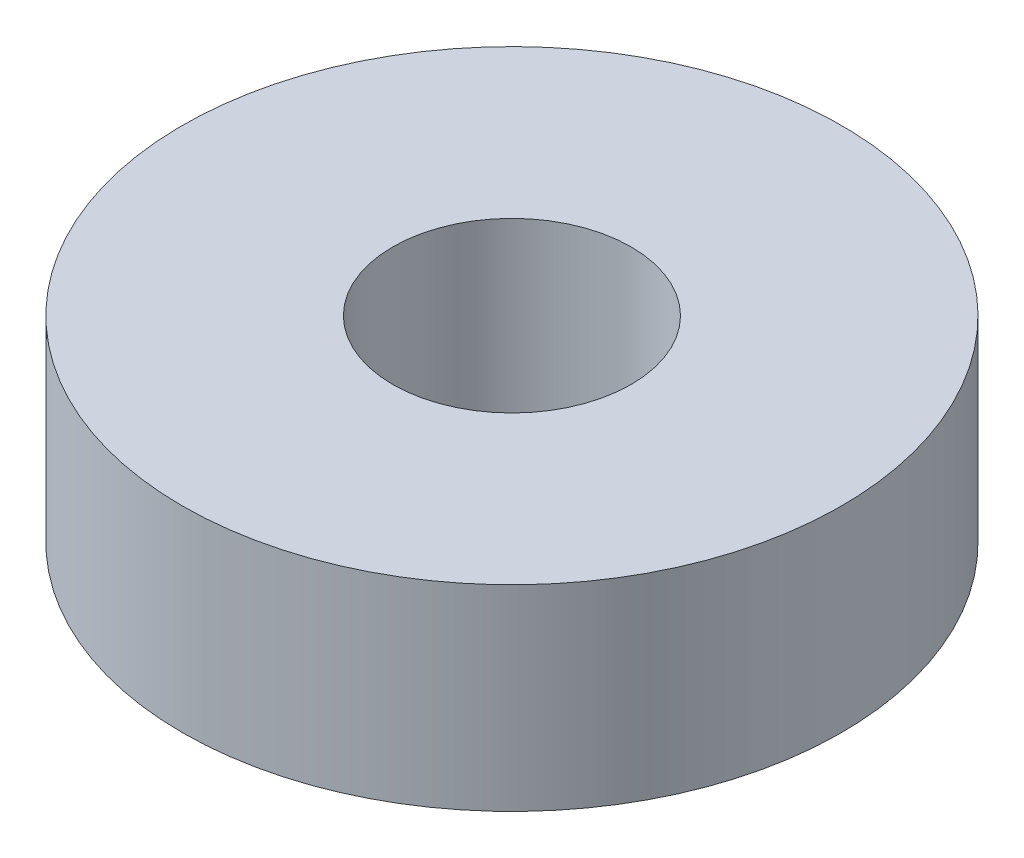
ISO-10303-21;
HEADER;
FILE_DESCRIPTION(('STEP AP214'),'2;1');
FILE_NAME('part.step','',(''),(''),'','','');
FILE_SCHEMA(('AUTOMOTIVE_DESIGN { 1 0 10303 214 1 1 1 1 }'));
ENDSEC;
DATA;
#1=APPLICATION_CONTEXT('core data for automotive mechanical design processes');
#2=APPLICATION_PROTOCOL_DEFINITION('international standard','automotive_design',2000,#1);
#3=PRODUCT_CONTEXT('',#1,'mechanical');
#4=PRODUCT('Part','Part','',(#3));
#5=PRODUCT_RELATED_PRODUCT_CATEGORY('part','',(#4));
#6=PRODUCT_DEFINITION_FORMATION('','',#4);
#7=PRODUCT_DEFINITION_CONTEXT('part definition',#1,'design');
#8=PRODUCT_DEFINITION('design','',#6,#7);
#9=PRODUCT_DEFINITION_SHAPE('','',#8);
#10=(LENGTH_UNIT() NAMED_UNIT(*) SI_UNIT(.MILLI.,.METRE.));
#11=(NAMED_UNIT(*) PLANE_ANGLE_UNIT() SI_UNIT($,.RADIAN.));
#12=(NAMED_UNIT(*) SI_UNIT($,.STERADIAN.) SOLID_ANGLE_UNIT());
#13=UNCERTAINTY_MEASURE_WITH_UNIT(LENGTH_MEASURE(1.E-05),#10,'distance_accuracy_value','');
#14=(GEOMETRIC_REPRESENTATION_CONTEXT(3) GLOBAL_UNCERTAINTY_ASSIGNED_CONTEXT((#13)) GLOBAL_UNIT_ASSIGNED_CONTEXT((#10,
#11,#12)) REPRESENTATION_CONTEXT('',''));
#15=CARTESIAN_POINT('',(0.,0.,0.));
#16=DIRECTION('',(0.,0.,1.));
#17=DIRECTION('',(1.,0.,0.));
#18=AXIS2_PLACEMENT_3D('',#15,#16,#17);
#19=CARTESIAN_POINT('',(0.,7.,0.));
#20=DIRECTION('',(0.,1.,0.));
#21=DIRECTION('',(0.,0.,1.));
#22=AXIS2_PLACEMENT_3D('',#19,#20,#21);
#23=PLANE('',#22);
#24=CARTESIAN_POINT('',(0.,7.,0.));
#25=DIRECTION('',(0.,1.,0.));
#26=DIRECTION('',(0.,0.,1.));
#27=AXIS2_PLACEMENT_3D('',#24,#25,#26);
#28=CIRCLE('',#27,23.5);
#29=CARTESIAN_POINT('',(0.,7.,23.5));
#30=VERTEX_POINT('',#29);
#31=EDGE_CURVE('E10',#30,#30,#28,.T.);
#32=ORIENTED_EDGE('',*,*,#31,.T.);
#33=EDGE_LOOP('',(#32));
#34=FACE_BOUND('',#33,.T.);
#35=CARTESIAN_POINT('',(0.,7.,0.));
#36=DIRECTION('',(0.,1.,0.));
#37=DIRECTION('',(0.,0.,1.));
#38=AXIS2_PLACEMENT_3D('',#35,#36,#37);
#39=CIRCLE('',#38,8.5);
#40=CARTESIAN_POINT('',(0.,7.,8.5));
#41=VERTEX_POINT('',#40);
#42=EDGE_CURVE('E50',#41,#41,#39,.T.);
#43=ORIENTED_EDGE('',*,*,#42,.F.);
#44=EDGE_LOOP('',(#43));
#45=FACE_BOUND('',#44,.T.);
#46=ADVANCED_FACE('F37',(#34,#45),#23,.T.);
#47=CARTESIAN_POINT('',(0.,-7.,0.));
#48=DIRECTION('',(0.,1.,0.));
#49=DIRECTION('',(0.,0.,1.));
#50=AXIS2_PLACEMENT_3D('',#47,#48,#49);
#51=PLANE('',#50);
#52=CARTESIAN_POINT('',(0.,-7.,0.));
#53=DIRECTION('',(0.,1.,0.));
#54=DIRECTION('',(0.,0.,1.));
#55=AXIS2_PLACEMENT_3D('',#52,#53,#54);
#56=CIRCLE('',#55,23.5);
#57=CARTESIAN_POINT('',(0.,-7.,23.5));
#58=VERTEX_POINT('',#57);
#59=EDGE_CURVE('E41',#58,#58,#56,.T.);
#60=ORIENTED_EDGE('',*,*,#59,.F.);
#61=EDGE_LOOP('',(#60));
#62=FACE_BOUND('',#61,.T.);
#63=CARTESIAN_POINT('',(0.,-7.,0.));
#64=DIRECTION('',(0.,1.,0.));
#65=DIRECTION('',(0.,0.,1.));
#66=AXIS2_PLACEMENT_3D('',#63,#64,#65);
#67=CIRCLE('',#66,8.5);
#68=CARTESIAN_POINT('',(0.,-7.,8.5));
#69=VERTEX_POINT('',#68);
#70=EDGE_CURVE('E52',#69,#69,#67,.T.);
#71=ORIENTED_EDGE('',*,*,#70,.T.);
#72=EDGE_LOOP('',(#71));
#73=FACE_BOUND('',#72,.T.);
#74=ADVANCED_FACE('F64',(#62,#73),#51,.F.);
#75=CARTESIAN_POINT('',(0.,7.,0.));
#76=DIRECTION('',(0.,-1.,0.));
#77=DIRECTION('',(0.,0.,-1.));
#78=AXIS2_PLACEMENT_3D('',#75,#76,#77);
#79=CYLINDRICAL_SURFACE('',#78,23.5);
#80=ORIENTED_EDGE('',*,*,#31,.F.);
#81=EDGE_LOOP('',(#80));
#82=FACE_BOUND('',#81,.T.);
#83=ORIENTED_EDGE('',*,*,#59,.T.);
#84=EDGE_LOOP('',(#83));
#85=FACE_BOUND('',#84,.T.);
#86=ADVANCED_FACE('F39',(#82,#85),#79,.T.);
#87=CARTESIAN_POINT('',(0.,7.,0.));
#88=DIRECTION('',(0.,-1.,0.));
#89=DIRECTION('',(0.,0.,-1.));
#90=AXIS2_PLACEMENT_3D('',#87,#88,#89);
#91=CYLINDRICAL_SURFACE('',#90,8.5);
#92=ORIENTED_EDGE('',*,*,#42,.T.);
#93=EDGE_LOOP('',(#92));
#94=FACE_BOUND('',#93,.T.);
#95=ORIENTED_EDGE('',*,*,#70,.F.);
#96=EDGE_LOOP('',(#95));
#97=FACE_BOUND('',#96,.T.);
#98=ADVANCED_FACE('F60',(#94,#97),#91,.F.);
#99=CLOSED_SHELL('',(#46,#74,#86,#98));
#100=MANIFOLD_SOLID_BREP('B2',#99);
#101=ADVANCED_BREP_SHAPE_REPRESENTATION('',(#18,#100),#14);
#102=SHAPE_DEFINITION_REPRESENTATION(#9,#101);
ENDSEC;
END-ISO-10303-21;
